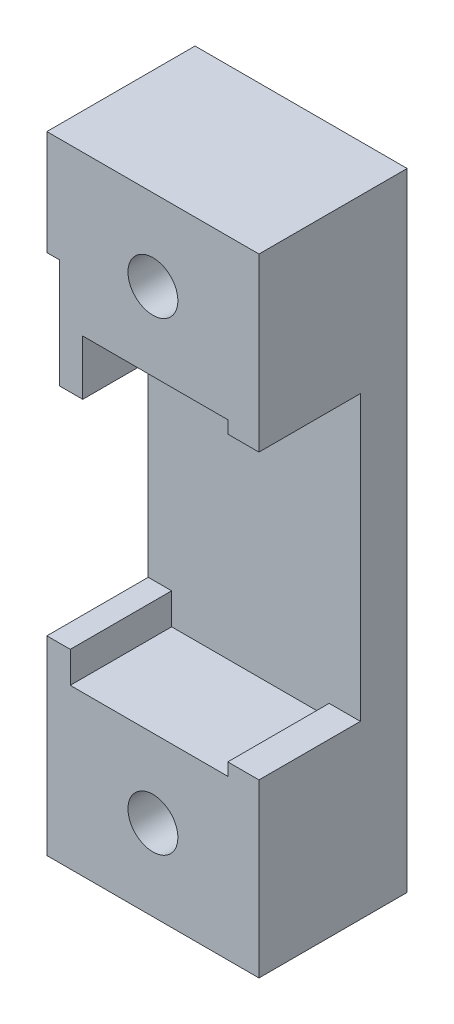
ISO-10303-21;
HEADER;
FILE_DESCRIPTION(('STEP AP214'),'2;1');
FILE_NAME('part.step','',(''),(''),'','','');
FILE_SCHEMA(('AUTOMOTIVE_DESIGN { 1 0 10303 214 1 1 1 1 }'));
ENDSEC;
DATA;
#1=APPLICATION_CONTEXT('core data for automotive mechanical design processes');
#2=APPLICATION_PROTOCOL_DEFINITION('international standard','automotive_design',2000,#1);
#3=PRODUCT_CONTEXT('',#1,'mechanical');
#4=PRODUCT('Part','Part','',(#3));
#5=PRODUCT_RELATED_PRODUCT_CATEGORY('part','',(#4));
#6=PRODUCT_DEFINITION_FORMATION('','',#4);
#7=PRODUCT_DEFINITION_CONTEXT('part definition',#1,'design');
#8=PRODUCT_DEFINITION('design','',#6,#7);
#9=PRODUCT_DEFINITION_SHAPE('','',#8);
#10=(LENGTH_UNIT() NAMED_UNIT(*) SI_UNIT(.MILLI.,.METRE.));
#11=(NAMED_UNIT(*) PLANE_ANGLE_UNIT() SI_UNIT($,.RADIAN.));
#12=(NAMED_UNIT(*) SI_UNIT($,.STERADIAN.) SOLID_ANGLE_UNIT());
#13=UNCERTAINTY_MEASURE_WITH_UNIT(LENGTH_MEASURE(1.E-05),#10,'distance_accuracy_value','');
#14=(GEOMETRIC_REPRESENTATION_CONTEXT(3) GLOBAL_UNCERTAINTY_ASSIGNED_CONTEXT((#13)) GLOBAL_UNIT_ASSIGNED_CONTEXT((#10,
#11,#12)) REPRESENTATION_CONTEXT('',''));
#15=CARTESIAN_POINT('',(0.,0.,0.));
#16=DIRECTION('',(0.,0.,1.));
#17=DIRECTION('',(1.,0.,0.));
#18=AXIS2_PLACEMENT_3D('',#15,#16,#17);
#19=CARTESIAN_POINT('',(-10.1,0.,6.5));
#20=DIRECTION('',(1.,0.,0.));
#21=DIRECTION('',(0.,0.,-1.));
#22=AXIS2_PLACEMENT_3D('',#19,#20,#21);
#23=PLANE('',#22);
#24=DIRECTION('',(0.,-1.,0.));
#25=VECTOR('',#24,1.);
#26=CARTESIAN_POINT('',(-10.1,0.,0.));
#27=LINE('',#26,#25);
#28=CARTESIAN_POINT('',(-10.1,-7.9,0.));
#29=VERTEX_POINT('',#28);
#30=CARTESIAN_POINT('',(-10.1,-9.9,0.));
#31=VERTEX_POINT('',#30);
#32=EDGE_CURVE('E305',#29,#31,#27,.T.);
#33=ORIENTED_EDGE('',*,*,#32,.F.);
#34=DIRECTION('',(0.,0.,-1.));
#35=VECTOR('',#34,1.);
#36=CARTESIAN_POINT('',(-10.1,-7.9,6.5));
#37=LINE('',#36,#35);
#38=CARTESIAN_POINT('',(-10.1,-7.9,6.5));
#39=VERTEX_POINT('',#38);
#40=EDGE_CURVE('E11',#39,#29,#37,.T.);
#41=ORIENTED_EDGE('',*,*,#40,.F.);
#42=DIRECTION('',(0.,-1.,0.));
#43=VECTOR('',#42,1.);
#44=CARTESIAN_POINT('',(-10.1,0.,6.5));
#45=LINE('',#44,#43);
#46=CARTESIAN_POINT('',(-10.1,-9.9,6.5));
#47=VERTEX_POINT('',#46);
#48=EDGE_CURVE('E308',#39,#47,#45,.T.);
#49=ORIENTED_EDGE('',*,*,#48,.T.);
#50=DIRECTION('',(0.,0.,-1.));
#51=VECTOR('',#50,1.);
#52=CARTESIAN_POINT('',(-10.1,-9.9,6.5));
#53=LINE('',#52,#51);
#54=EDGE_CURVE('E344',#47,#31,#53,.T.);
#55=ORIENTED_EDGE('',*,*,#54,.T.);
#56=EDGE_LOOP('',(#33,#41,#49,#55));
#57=FACE_BOUND('',#56,.T.);
#58=ADVANCED_FACE('F47',(#57),#23,.T.);
#59=CARTESIAN_POINT('',(0.,-7.9,6.5));
#60=DIRECTION('',(0.,1.,0.));
#61=DIRECTION('',(0.,0.,1.));
#62=AXIS2_PLACEMENT_3D('',#59,#60,#61);
#63=PLANE('',#62);
#64=DIRECTION('',(1.,0.,0.));
#65=VECTOR('',#64,1.);
#66=CARTESIAN_POINT('',(0.,-7.9,0.));
#67=LINE('',#66,#65);
#68=CARTESIAN_POINT('',(-11.6,-7.9,0.));
#69=VERTEX_POINT('',#68);
#70=EDGE_CURVE('E348',#69,#29,#67,.T.);
#71=ORIENTED_EDGE('',*,*,#70,.F.);
#72=DIRECTION('',(0.,0.,-1.));
#73=VECTOR('',#72,1.);
#74=CARTESIAN_POINT('',(-11.6,-7.9,6.5));
#75=LINE('',#74,#73);
#76=CARTESIAN_POINT('',(-11.6,-7.9,6.5));
#77=VERTEX_POINT('',#76);
#78=EDGE_CURVE('E56',#77,#69,#75,.T.);
#79=ORIENTED_EDGE('',*,*,#78,.F.);
#80=DIRECTION('',(1.,0.,0.));
#81=VECTOR('',#80,1.);
#82=CARTESIAN_POINT('',(0.,-7.9,6.5));
#83=LINE('',#82,#81);
#84=EDGE_CURVE('E312',#77,#39,#83,.T.);
#85=ORIENTED_EDGE('',*,*,#84,.T.);
#86=ORIENTED_EDGE('',*,*,#40,.T.);
#87=EDGE_LOOP('',(#71,#79,#85,#86));
#88=FACE_BOUND('',#87,.T.);
#89=ADVANCED_FACE('F420',(#88),#63,.T.);
#90=CARTESIAN_POINT('',(-11.6,0.,6.5));
#91=DIRECTION('',(-1.,0.,0.));
#92=DIRECTION('',(0.,0.,1.));
#93=AXIS2_PLACEMENT_3D('',#90,#91,#92);
#94=PLANE('',#93);
#95=ORIENTED_EDGE('',*,*,#78,.T.);
#96=DIRECTION('',(0.,1.,0.));
#97=VECTOR('',#96,1.);
#98=CARTESIAN_POINT('',(-11.6,0.,0.));
#99=LINE('',#98,#97);
#100=CARTESIAN_POINT('',(-11.6,13.3788987470405,0.));
#101=VERTEX_POINT('',#100);
#102=EDGE_CURVE('E180',#69,#101,#99,.T.);
#103=ORIENTED_EDGE('',*,*,#102,.T.);
#104=DIRECTION('',(0.,0.,-1.));
#105=VECTOR('',#104,1.);
#106=CARTESIAN_POINT('',(-11.6,13.3788987470405,6.5));
#107=LINE('',#106,#105);
#108=CARTESIAN_POINT('',(-11.6,13.3788987470405,6.5));
#109=VERTEX_POINT('',#108);
#110=EDGE_CURVE('E174',#109,#101,#107,.T.);
#111=ORIENTED_EDGE('',*,*,#110,.F.);
#112=DIRECTION('',(0.,1.,0.));
#113=VECTOR('',#112,1.);
#114=CARTESIAN_POINT('',(-11.6,0.,6.5));
#115=LINE('',#114,#113);
#116=CARTESIAN_POINT('',(-11.6,20.1,6.5));
#117=VERTEX_POINT('',#116);
#118=EDGE_CURVE('E178',#109,#117,#115,.T.);
#119=ORIENTED_EDGE('',*,*,#118,.T.);
#120=DIRECTION('',(0.,0.,1.));
#121=VECTOR('',#120,1.);
#122=CARTESIAN_POINT('',(-11.6,20.1,-3.));
#123=LINE('',#122,#121);
#124=CARTESIAN_POINT('',(-11.6,20.1,-3.));
#125=VERTEX_POINT('',#124);
#126=EDGE_CURVE('E302',#125,#117,#123,.T.);
#127=ORIENTED_EDGE('',*,*,#126,.F.);
#128=DIRECTION('',(0.,1.,0.));
#129=VECTOR('',#128,1.);
#130=CARTESIAN_POINT('',(-11.6,0.,-3.));
#131=LINE('',#130,#129);
#132=CARTESIAN_POINT('',(-11.6,-20.1,-3.));
#133=VERTEX_POINT('',#132);
#134=EDGE_CURVE('E281',#133,#125,#131,.T.);
#135=ORIENTED_EDGE('',*,*,#134,.F.);
#136=DIRECTION('',(0.,0.,-1.));
#137=VECTOR('',#136,1.);
#138=CARTESIAN_POINT('',(-11.6,-20.1,6.5));
#139=LINE('',#138,#137);
#140=CARTESIAN_POINT('',(-11.6,-20.1,6.5));
#141=VERTEX_POINT('',#140);
#142=EDGE_CURVE('E377',#141,#133,#139,.T.);
#143=ORIENTED_EDGE('',*,*,#142,.F.);
#144=DIRECTION('',(0.,1.,0.));
#145=VECTOR('',#144,1.);
#146=CARTESIAN_POINT('',(-11.6,0.,6.5));
#147=LINE('',#146,#145);
#148=EDGE_CURVE('E317',#141,#77,#147,.T.);
#149=ORIENTED_EDGE('',*,*,#148,.T.);
#150=EDGE_LOOP('',(#95,#103,#111,#119,#127,#135,#143,#149));
#151=FACE_BOUND('',#150,.T.);
#152=ADVANCED_FACE('F176',(#151),#94,.T.);
#153=CARTESIAN_POINT('',(0.,-20.1,6.5));
#154=DIRECTION('',(0.,-1.,0.));
#155=DIRECTION('',(1.,0.,0.));
#156=AXIS2_PLACEMENT_3D('',#153,#154,#155);
#157=PLANE('',#156);
#158=ORIENTED_EDGE('',*,*,#142,.T.);
#159=DIRECTION('',(-1.,0.,0.));
#160=VECTOR('',#159,1.);
#161=CARTESIAN_POINT('',(0.,-20.1,-3.));
#162=LINE('',#161,#160);
#163=CARTESIAN_POINT('',(2.,-20.1,-3.));
#164=VERTEX_POINT('',#163);
#165=EDGE_CURVE('E284',#164,#133,#162,.T.);
#166=ORIENTED_EDGE('',*,*,#165,.F.);
#167=DIRECTION('',(0.,0.,-1.));
#168=VECTOR('',#167,1.);
#169=CARTESIAN_POINT('',(2.,-20.1,6.5));
#170=LINE('',#169,#168);
#171=CARTESIAN_POINT('',(2.,-20.1,6.5));
#172=VERTEX_POINT('',#171);
#173=EDGE_CURVE('E374',#172,#164,#170,.T.);
#174=ORIENTED_EDGE('',*,*,#173,.F.);
#175=DIRECTION('',(-1.,0.,0.));
#176=VECTOR('',#175,1.);
#177=CARTESIAN_POINT('',(0.,-20.1,6.5));
#178=LINE('',#177,#176);
#179=EDGE_CURVE('E321',#172,#141,#178,.T.);
#180=ORIENTED_EDGE('',*,*,#179,.T.);
#181=EDGE_LOOP('',(#158,#166,#174,#180));
#182=FACE_BOUND('',#181,.T.);
#183=ADVANCED_FACE('F498',(#182),#157,.T.);
#184=CARTESIAN_POINT('',(2.,0.,6.5));
#185=DIRECTION('',(1.,0.,0.));
#186=DIRECTION('',(0.,1.,0.));
#187=AXIS2_PLACEMENT_3D('',#184,#185,#186);
#188=PLANE('',#187);
#189=ORIENTED_EDGE('',*,*,#173,.T.);
#190=DIRECTION('',(0.,1.,0.));
#191=VECTOR('',#190,1.);
#192=CARTESIAN_POINT('',(2.,0.,-3.));
#193=LINE('',#192,#191);
#194=CARTESIAN_POINT('',(2.,20.1,-3.));
#195=VERTEX_POINT('',#194);
#196=EDGE_CURVE('E289',#164,#195,#193,.T.);
#197=ORIENTED_EDGE('',*,*,#196,.T.);
#198=DIRECTION('',(0.,0.,1.));
#199=VECTOR('',#198,1.);
#200=CARTESIAN_POINT('',(2.,20.1,-3.));
#201=LINE('',#200,#199);
#202=CARTESIAN_POINT('',(2.,20.1,6.5));
#203=VERTEX_POINT('',#202);
#204=EDGE_CURVE('E297',#195,#203,#201,.T.);
#205=ORIENTED_EDGE('',*,*,#204,.T.);
#206=DIRECTION('',(0.,1.,0.));
#207=VECTOR('',#206,1.);
#208=CARTESIAN_POINT('',(2.,0.,6.5));
#209=LINE('',#208,#207);
#210=CARTESIAN_POINT('',(2.,9.1,6.5));
#211=VERTEX_POINT('',#210);
#212=EDGE_CURVE('E226',#211,#203,#209,.T.);
#213=ORIENTED_EDGE('',*,*,#212,.F.);
#214=DIRECTION('',(0.,0.,-1.));
#215=VECTOR('',#214,1.);
#216=CARTESIAN_POINT('',(2.,9.1,6.5));
#217=LINE('',#216,#215);
#218=CARTESIAN_POINT('',(2.,9.1,0.));
#219=VERTEX_POINT('',#218);
#220=EDGE_CURVE('E235',#211,#219,#217,.T.);
#221=ORIENTED_EDGE('',*,*,#220,.T.);
#222=DIRECTION('',(0.,1.,0.));
#223=VECTOR('',#222,1.);
#224=CARTESIAN_POINT('',(2.,0.,0.));
#225=LINE('',#224,#223);
#226=CARTESIAN_POINT('',(2.,-9.1,0.));
#227=VERTEX_POINT('',#226);
#228=EDGE_CURVE('E285',#227,#219,#225,.T.);
#229=ORIENTED_EDGE('',*,*,#228,.F.);
#230=DIRECTION('',(0.,0.,-1.));
#231=VECTOR('',#230,1.);
#232=CARTESIAN_POINT('',(2.,-9.1,6.5));
#233=LINE('',#232,#231);
#234=CARTESIAN_POINT('',(2.,-9.1,6.5));
#235=VERTEX_POINT('',#234);
#236=EDGE_CURVE('E371',#235,#227,#233,.T.);
#237=ORIENTED_EDGE('',*,*,#236,.F.);
#238=DIRECTION('',(0.,-1.,0.));
#239=VECTOR('',#238,1.);
#240=CARTESIAN_POINT('',(2.,0.,6.5));
#241=LINE('',#240,#239);
#242=EDGE_CURVE('E325',#235,#172,#241,.T.);
#243=ORIENTED_EDGE('',*,*,#242,.T.);
#244=EDGE_LOOP('',(#189,#197,#205,#213,#221,#229,#237,#243));
#245=FACE_BOUND('',#244,.T.);
#246=ADVANCED_FACE('F490',(#245),#188,.T.);
#247=CARTESIAN_POINT('',(0.,-9.1,6.5));
#248=DIRECTION('',(0.,1.,0.));
#249=DIRECTION('',(0.,0.,1.));
#250=AXIS2_PLACEMENT_3D('',#247,#248,#249);
#251=PLANE('',#250);
#252=DIRECTION('',(1.,0.,0.));
#253=VECTOR('',#252,1.);
#254=CARTESIAN_POINT('',(0.,-9.1,0.));
#255=LINE('',#254,#253);
#256=CARTESIAN_POINT('',(0.,-9.1,0.));
#257=VERTEX_POINT('',#256);
#258=EDGE_CURVE('E352',#257,#227,#255,.T.);
#259=ORIENTED_EDGE('',*,*,#258,.F.);
#260=DIRECTION('',(0.,0.,-1.));
#261=VECTOR('',#260,1.);
#262=CARTESIAN_POINT('',(0.,-9.1,6.5));
#263=LINE('',#262,#261);
#264=CARTESIAN_POINT('',(0.,-9.1,6.5));
#265=VERTEX_POINT('',#264);
#266=EDGE_CURVE('E368',#265,#257,#263,.T.);
#267=ORIENTED_EDGE('',*,*,#266,.F.);
#268=DIRECTION('',(1.,0.,0.));
#269=VECTOR('',#268,1.);
#270=CARTESIAN_POINT('',(0.,-9.1,6.5));
#271=LINE('',#270,#269);
#272=EDGE_CURVE('E329',#265,#235,#271,.T.);
#273=ORIENTED_EDGE('',*,*,#272,.T.);
#274=ORIENTED_EDGE('',*,*,#236,.T.);
#275=EDGE_LOOP('',(#259,#267,#273,#274));
#276=FACE_BOUND('',#275,.T.);
#277=ADVANCED_FACE('F504',(#276),#251,.T.);
#278=CARTESIAN_POINT('',(0.,0.,6.5));
#279=DIRECTION('',(-1.,0.,0.));
#280=DIRECTION('',(0.,0.,1.));
#281=AXIS2_PLACEMENT_3D('',#278,#279,#280);
#282=PLANE('',#281);
#283=DIRECTION('',(0.,1.,0.));
#284=VECTOR('',#283,1.);
#285=CARTESIAN_POINT('',(0.,0.,0.));
#286=LINE('',#285,#284);
#287=CARTESIAN_POINT('',(0.,-9.9,0.));
#288=VERTEX_POINT('',#287);
#289=EDGE_CURVE('E356',#288,#257,#286,.T.);
#290=ORIENTED_EDGE('',*,*,#289,.F.);
#291=DIRECTION('',(0.,0.,-1.));
#292=VECTOR('',#291,1.);
#293=CARTESIAN_POINT('',(0.,-9.9,6.5));
#294=LINE('',#293,#292);
#295=CARTESIAN_POINT('',(0.,-9.9,6.5));
#296=VERTEX_POINT('',#295);
#297=EDGE_CURVE('E365',#296,#288,#294,.T.);
#298=ORIENTED_EDGE('',*,*,#297,.F.);
#299=DIRECTION('',(0.,1.,0.));
#300=VECTOR('',#299,1.);
#301=CARTESIAN_POINT('',(0.,0.,6.5));
#302=LINE('',#301,#300);
#303=EDGE_CURVE('E333',#296,#265,#302,.T.);
#304=ORIENTED_EDGE('',*,*,#303,.T.);
#305=ORIENTED_EDGE('',*,*,#266,.T.);
#306=EDGE_LOOP('',(#290,#298,#304,#305));
#307=FACE_BOUND('',#306,.T.);
#308=ADVANCED_FACE('F507',(#307),#282,.T.);
#309=CARTESIAN_POINT('',(0.,-9.9,6.5));
#310=DIRECTION('',(0.,-1.,0.));
#311=DIRECTION('',(0.,0.,-1.));
#312=AXIS2_PLACEMENT_3D('',#309,#310,#311);
#313=PLANE('',#312);
#314=DIRECTION('',(-1.,0.,0.));
#315=VECTOR('',#314,1.);
#316=CARTESIAN_POINT('',(0.,-9.9,0.));
#317=LINE('',#316,#315);
#318=EDGE_CURVE('E313',#288,#31,#317,.T.);
#319=ORIENTED_EDGE('',*,*,#318,.T.);
#320=ORIENTED_EDGE('',*,*,#54,.F.);
#321=DIRECTION('',(-1.,0.,0.));
#322=VECTOR('',#321,1.);
#323=CARTESIAN_POINT('',(0.,-9.9,6.5));
#324=LINE('',#323,#322);
#325=EDGE_CURVE('E337',#296,#47,#324,.T.);
#326=ORIENTED_EDGE('',*,*,#325,.F.);
#327=ORIENTED_EDGE('',*,*,#297,.T.);
#328=EDGE_LOOP('',(#319,#320,#326,#327));
#329=FACE_BOUND('',#328,.T.);
#330=ADVANCED_FACE('F405',(#329),#313,.F.);
#331=CARTESIAN_POINT('',(-4.8,-14.9,6.5));
#332=DIRECTION('',(0.,0.,-1.));
#333=DIRECTION('',(-1.,0.,0.));
#334=AXIS2_PLACEMENT_3D('',#331,#332,#333);
#335=CYLINDRICAL_SURFACE('',#334,1.6);
#336=CARTESIAN_POINT('',(-4.8,-14.9,0.5));
#337=DIRECTION('',(0.,0.,1.));
#338=DIRECTION('',(1.,0.,0.));
#339=AXIS2_PLACEMENT_3D('',#336,#337,#338);
#340=CIRCLE('',#339,1.6);
#341=CARTESIAN_POINT('',(-3.2,-14.9,0.5));
#342=VERTEX_POINT('',#341);
#343=EDGE_CURVE('E50',#342,#342,#340,.T.);
#344=ORIENTED_EDGE('',*,*,#343,.F.);
#345=EDGE_LOOP('',(#344));
#346=FACE_BOUND('',#345,.T.);
#347=CARTESIAN_POINT('',(-4.8,-14.9,6.5));
#348=DIRECTION('',(0.,0.,1.));
#349=DIRECTION('',(1.,0.,0.));
#350=AXIS2_PLACEMENT_3D('',#347,#348,#349);
#351=CIRCLE('',#350,1.6);
#352=CARTESIAN_POINT('',(-3.2,-14.9,6.5));
#353=VERTEX_POINT('',#352);
#354=EDGE_CURVE('E340',#353,#353,#351,.T.);
#355=ORIENTED_EDGE('',*,*,#354,.T.);
#356=EDGE_LOOP('',(#355));
#357=FACE_BOUND('',#356,.T.);
#358=ADVANCED_FACE('F401',(#346,#357),#335,.F.);
#359=CARTESIAN_POINT('',(0.,0.,6.5));
#360=DIRECTION('',(0.,0.,1.));
#361=DIRECTION('',(1.,0.,0.));
#362=AXIS2_PLACEMENT_3D('',#359,#360,#361);
#363=PLANE('',#362);
#364=ORIENTED_EDGE('',*,*,#48,.F.);
#365=ORIENTED_EDGE('',*,*,#84,.F.);
#366=ORIENTED_EDGE('',*,*,#148,.F.);
#367=ORIENTED_EDGE('',*,*,#179,.F.);
#368=ORIENTED_EDGE('',*,*,#242,.F.);
#369=ORIENTED_EDGE('',*,*,#272,.F.);
#370=ORIENTED_EDGE('',*,*,#303,.F.);
#371=ORIENTED_EDGE('',*,*,#325,.T.);
#372=EDGE_LOOP('',(#364,#365,#366,#367,#368,#369,#370,#371));
#373=FACE_BOUND('',#372,.T.);
#374=ORIENTED_EDGE('',*,*,#354,.F.);
#375=EDGE_LOOP('',(#374));
#376=FACE_BOUND('',#375,.T.);
#377=ADVANCED_FACE('F404',(#373,#376),#363,.T.);
#378=CARTESIAN_POINT('',(0.,20.1,-3.));
#379=DIRECTION('',(0.,1.,0.));
#380=DIRECTION('',(0.,0.,1.));
#381=AXIS2_PLACEMENT_3D('',#378,#379,#380);
#382=PLANE('',#381);
#383=ORIENTED_EDGE('',*,*,#126,.T.);
#384=DIRECTION('',(-1.,0.,0.));
#385=VECTOR('',#384,1.);
#386=CARTESIAN_POINT('',(0.,20.1,6.5));
#387=LINE('',#386,#385);
#388=EDGE_CURVE('E197',#203,#117,#387,.T.);
#389=ORIENTED_EDGE('',*,*,#388,.F.);
#390=ORIENTED_EDGE('',*,*,#204,.F.);
#391=DIRECTION('',(-1.,0.,0.));
#392=VECTOR('',#391,1.);
#393=CARTESIAN_POINT('',(0.,20.1,-3.));
#394=LINE('',#393,#392);
#395=EDGE_CURVE('E293',#195,#125,#394,.T.);
#396=ORIENTED_EDGE('',*,*,#395,.T.);
#397=EDGE_LOOP('',(#383,#389,#390,#396));
#398=FACE_BOUND('',#397,.T.);
#399=ADVANCED_FACE('F410',(#398),#382,.T.);
#400=CARTESIAN_POINT('',(-4.8,14.9,-3.));
#401=DIRECTION('',(0.,0.,1.));
#402=DIRECTION('',(1.,0.,0.));
#403=AXIS2_PLACEMENT_3D('',#400,#401,#402);
#404=CYLINDRICAL_SURFACE('',#403,1.6);
#405=CARTESIAN_POINT('',(-4.8,14.9,0.5));
#406=DIRECTION('',(0.,0.,1.));
#407=DIRECTION('',(1.,0.,0.));
#408=AXIS2_PLACEMENT_3D('',#405,#406,#407);
#409=CIRCLE('',#408,1.6);
#410=CARTESIAN_POINT('',(-3.2,14.9,0.5));
#411=VERTEX_POINT('',#410);
#412=EDGE_CURVE('E390',#411,#411,#409,.F.);
#413=ORIENTED_EDGE('',*,*,#412,.T.);
#414=EDGE_LOOP('',(#413));
#415=FACE_BOUND('',#414,.T.);
#416=CARTESIAN_POINT('',(-4.8,14.9,6.5));
#417=DIRECTION('',(0.,0.,1.));
#418=DIRECTION('',(1.,0.,0.));
#419=AXIS2_PLACEMENT_3D('',#416,#417,#418);
#420=CIRCLE('',#419,1.6);
#421=CARTESIAN_POINT('',(-3.2,14.9,6.5));
#422=VERTEX_POINT('',#421);
#423=EDGE_CURVE('E231',#422,#422,#420,.T.);
#424=ORIENTED_EDGE('',*,*,#423,.T.);
#425=EDGE_LOOP('',(#424));
#426=FACE_BOUND('',#425,.T.);
#427=ADVANCED_FACE('F415',(#415,#426),#404,.F.);
#428=CARTESIAN_POINT('',(0.,0.,-3.));
#429=DIRECTION('',(0.,0.,1.));
#430=DIRECTION('',(1.,0.,0.));
#431=AXIS2_PLACEMENT_3D('',#428,#429,#430);
#432=PLANE('',#431);
#433=CARTESIAN_POINT('',(-4.8,14.9,-3.));
#434=DIRECTION('',(0.,0.,1.));
#435=DIRECTION('',(1.,0.,0.));
#436=AXIS2_PLACEMENT_3D('',#433,#434,#435);
#437=CIRCLE('',#436,2.85);
#438=CARTESIAN_POINT('',(-1.95,14.9,-3.));
#439=VERTEX_POINT('',#438);
#440=EDGE_CURVE('E386',#439,#439,#437,.T.);
#441=ORIENTED_EDGE('',*,*,#440,.T.);
#442=EDGE_LOOP('',(#441));
#443=FACE_BOUND('',#442,.T.);
#444=CARTESIAN_POINT('',(-4.8,-14.9,-3.));
#445=DIRECTION('',(0.,0.,1.));
#446=DIRECTION('',(1.,0.,0.));
#447=AXIS2_PLACEMENT_3D('',#444,#445,#446);
#448=CIRCLE('',#447,2.85);
#449=CARTESIAN_POINT('',(-1.95,-14.9,-3.));
#450=VERTEX_POINT('',#449);
#451=EDGE_CURVE('E382',#450,#450,#448,.T.);
#452=ORIENTED_EDGE('',*,*,#451,.T.);
#453=EDGE_LOOP('',(#452));
#454=FACE_BOUND('',#453,.T.);
#455=ORIENTED_EDGE('',*,*,#134,.T.);
#456=ORIENTED_EDGE('',*,*,#395,.F.);
#457=ORIENTED_EDGE('',*,*,#196,.F.);
#458=ORIENTED_EDGE('',*,*,#165,.T.);
#459=EDGE_LOOP('',(#455,#456,#457,#458));
#460=FACE_BOUND('',#459,.T.);
#461=ADVANCED_FACE('F431',(#443,#454,#460),#432,.F.);
#462=CARTESIAN_POINT('',(0.,0.,0.));
#463=DIRECTION('',(0.,0.,1.));
#464=DIRECTION('',(1.,0.,0.));
#465=AXIS2_PLACEMENT_3D('',#462,#463,#464);
#466=PLANE('',#465);
#467=DIRECTION('',(-1.,0.,0.));
#468=VECTOR('',#467,1.);
#469=CARTESIAN_POINT('',(0.,13.3788987470405,0.));
#470=LINE('',#469,#468);
#471=CARTESIAN_POINT('',(-10.8,13.3788987470405,0.));
#472=VERTEX_POINT('',#471);
#473=EDGE_CURVE('E236',#472,#101,#470,.T.);
#474=ORIENTED_EDGE('',*,*,#473,.T.);
#475=ORIENTED_EDGE('',*,*,#102,.F.);
#476=ORIENTED_EDGE('',*,*,#70,.T.);
#477=ORIENTED_EDGE('',*,*,#32,.T.);
#478=ORIENTED_EDGE('',*,*,#318,.F.);
#479=ORIENTED_EDGE('',*,*,#289,.T.);
#480=ORIENTED_EDGE('',*,*,#258,.T.);
#481=ORIENTED_EDGE('',*,*,#228,.T.);
#482=DIRECTION('',(1.,0.,0.));
#483=VECTOR('',#482,1.);
#484=CARTESIAN_POINT('',(0.,9.1,0.));
#485=LINE('',#484,#483);
#486=CARTESIAN_POINT('',(0.,9.1,0.));
#487=VERTEX_POINT('',#486);
#488=EDGE_CURVE('E199',#487,#219,#485,.T.);
#489=ORIENTED_EDGE('',*,*,#488,.F.);
#490=DIRECTION('',(0.,-1.,0.));
#491=VECTOR('',#490,1.);
#492=CARTESIAN_POINT('',(0.,0.,0.));
#493=LINE('',#492,#491);
#494=CARTESIAN_POINT('',(0.,9.9,0.));
#495=VERTEX_POINT('',#494);
#496=EDGE_CURVE('E250',#495,#487,#493,.T.);
#497=ORIENTED_EDGE('',*,*,#496,.F.);
#498=DIRECTION('',(-1.,0.,0.));
#499=VECTOR('',#498,1.);
#500=CARTESIAN_POINT('',(0.,9.9,0.));
#501=LINE('',#500,#499);
#502=CARTESIAN_POINT('',(-9.3,9.9,0.));
#503=VERTEX_POINT('',#502);
#504=EDGE_CURVE('E247',#495,#503,#501,.T.);
#505=ORIENTED_EDGE('',*,*,#504,.T.);
#506=DIRECTION('',(0.,1.,0.));
#507=VECTOR('',#506,1.);
#508=CARTESIAN_POINT('',(-9.3,0.,0.));
#509=LINE('',#508,#507);
#510=CARTESIAN_POINT('',(-9.3,6.37889874704045,0.));
#511=VERTEX_POINT('',#510);
#512=EDGE_CURVE('E243',#511,#503,#509,.T.);
#513=ORIENTED_EDGE('',*,*,#512,.F.);
#514=DIRECTION('',(1.,0.,0.));
#515=VECTOR('',#514,1.);
#516=CARTESIAN_POINT('',(0.,6.37889874704045,0.));
#517=LINE('',#516,#515);
#518=CARTESIAN_POINT('',(-10.8,6.37889874704045,0.));
#519=VERTEX_POINT('',#518);
#520=EDGE_CURVE('E69',#519,#511,#517,.T.);
#521=ORIENTED_EDGE('',*,*,#520,.F.);
#522=DIRECTION('',(0.,1.,0.));
#523=VECTOR('',#522,1.);
#524=CARTESIAN_POINT('',(-10.8,0.,0.));
#525=LINE('',#524,#523);
#526=EDGE_CURVE('E64',#519,#472,#525,.T.);
#527=ORIENTED_EDGE('',*,*,#526,.T.);
#528=EDGE_LOOP('',(#474,#475,#476,#477,#478,#479,#480,#481,#489,#497,#505,#513,#521,#527));
#529=FACE_BOUND('',#528,.T.);
#530=ADVANCED_FACE('F429',(#529),#466,.T.);
#531=CARTESIAN_POINT('',(0.,13.3788987470405,6.5));
#532=DIRECTION('',(0.,-1.,0.));
#533=DIRECTION('',(0.,0.,-1.));
#534=AXIS2_PLACEMENT_3D('',#531,#532,#533);
#535=PLANE('',#534);
#536=ORIENTED_EDGE('',*,*,#473,.F.);
#537=DIRECTION('',(0.,0.,-1.));
#538=VECTOR('',#537,1.);
#539=CARTESIAN_POINT('',(-10.8,13.3788987470405,6.5));
#540=LINE('',#539,#538);
#541=CARTESIAN_POINT('',(-10.8,13.3788987470405,6.5));
#542=VERTEX_POINT('',#541);
#543=EDGE_CURVE('E185',#542,#472,#540,.T.);
#544=ORIENTED_EDGE('',*,*,#543,.F.);
#545=DIRECTION('',(-1.,0.,0.));
#546=VECTOR('',#545,1.);
#547=CARTESIAN_POINT('',(0.,13.3788987470405,6.5));
#548=LINE('',#547,#546);
#549=EDGE_CURVE('E193',#542,#109,#548,.T.);
#550=ORIENTED_EDGE('',*,*,#549,.T.);
#551=ORIENTED_EDGE('',*,*,#110,.T.);
#552=EDGE_LOOP('',(#536,#544,#550,#551));
#553=FACE_BOUND('',#552,.T.);
#554=ADVANCED_FACE('F201',(#553),#535,.T.);
#555=CARTESIAN_POINT('',(-10.8,0.,6.5));
#556=DIRECTION('',(-1.,0.,0.));
#557=DIRECTION('',(0.,0.,1.));
#558=AXIS2_PLACEMENT_3D('',#555,#556,#557);
#559=PLANE('',#558);
#560=ORIENTED_EDGE('',*,*,#526,.F.);
#561=DIRECTION('',(0.,0.,-1.));
#562=VECTOR('',#561,1.);
#563=CARTESIAN_POINT('',(-10.8,6.37889874704045,6.5));
#564=LINE('',#563,#562);
#565=CARTESIAN_POINT('',(-10.8,6.37889874704045,6.5));
#566=VERTEX_POINT('',#565);
#567=EDGE_CURVE('E276',#566,#519,#564,.T.);
#568=ORIENTED_EDGE('',*,*,#567,.F.);
#569=DIRECTION('',(0.,1.,0.));
#570=VECTOR('',#569,1.);
#571=CARTESIAN_POINT('',(-10.8,0.,6.5));
#572=LINE('',#571,#570);
#573=EDGE_CURVE('E203',#566,#542,#572,.T.);
#574=ORIENTED_EDGE('',*,*,#573,.T.);
#575=ORIENTED_EDGE('',*,*,#543,.T.);
#576=EDGE_LOOP('',(#560,#568,#574,#575));
#577=FACE_BOUND('',#576,.T.);
#578=ADVANCED_FACE('F436',(#577),#559,.T.);
#579=CARTESIAN_POINT('',(0.,6.37889874704045,6.5));
#580=DIRECTION('',(0.,1.,0.));
#581=DIRECTION('',(0.,0.,1.));
#582=AXIS2_PLACEMENT_3D('',#579,#580,#581);
#583=PLANE('',#582);
#584=ORIENTED_EDGE('',*,*,#520,.T.);
#585=DIRECTION('',(0.,0.,-1.));
#586=VECTOR('',#585,1.);
#587=CARTESIAN_POINT('',(-9.3,6.37889874704045,6.5));
#588=LINE('',#587,#586);
#589=CARTESIAN_POINT('',(-9.3,6.37889874704045,6.5));
#590=VERTEX_POINT('',#589);
#591=EDGE_CURVE('E272',#590,#511,#588,.T.);
#592=ORIENTED_EDGE('',*,*,#591,.F.);
#593=DIRECTION('',(1.,0.,0.));
#594=VECTOR('',#593,1.);
#595=CARTESIAN_POINT('',(0.,6.37889874704045,6.5));
#596=LINE('',#595,#594);
#597=EDGE_CURVE('E207',#566,#590,#596,.T.);
#598=ORIENTED_EDGE('',*,*,#597,.F.);
#599=ORIENTED_EDGE('',*,*,#567,.T.);
#600=EDGE_LOOP('',(#584,#592,#598,#599));
#601=FACE_BOUND('',#600,.T.);
#602=ADVANCED_FACE('F469',(#601),#583,.F.);
#603=CARTESIAN_POINT('',(-9.3,0.,6.5));
#604=DIRECTION('',(-1.,0.,0.));
#605=DIRECTION('',(0.,0.,1.));
#606=AXIS2_PLACEMENT_3D('',#603,#604,#605);
#607=PLANE('',#606);
#608=ORIENTED_EDGE('',*,*,#512,.T.);
#609=DIRECTION('',(0.,0.,-1.));
#610=VECTOR('',#609,1.);
#611=CARTESIAN_POINT('',(-9.3,9.9,6.5));
#612=LINE('',#611,#610);
#613=CARTESIAN_POINT('',(-9.3,9.9,6.5));
#614=VERTEX_POINT('',#613);
#615=EDGE_CURVE('E268',#614,#503,#612,.T.);
#616=ORIENTED_EDGE('',*,*,#615,.F.);
#617=DIRECTION('',(0.,1.,0.));
#618=VECTOR('',#617,1.);
#619=CARTESIAN_POINT('',(-9.3,0.,6.5));
#620=LINE('',#619,#618);
#621=EDGE_CURVE('E213',#590,#614,#620,.T.);
#622=ORIENTED_EDGE('',*,*,#621,.F.);
#623=ORIENTED_EDGE('',*,*,#591,.T.);
#624=EDGE_LOOP('',(#608,#616,#622,#623));
#625=FACE_BOUND('',#624,.T.);
#626=ADVANCED_FACE('F465',(#625),#607,.F.);
#627=CARTESIAN_POINT('',(0.,9.9,6.5));
#628=DIRECTION('',(0.,-1.,0.));
#629=DIRECTION('',(1.,0.,0.));
#630=AXIS2_PLACEMENT_3D('',#627,#628,#629);
#631=PLANE('',#630);
#632=ORIENTED_EDGE('',*,*,#504,.F.);
#633=DIRECTION('',(0.,0.,-1.));
#634=VECTOR('',#633,1.);
#635=CARTESIAN_POINT('',(0.,9.9,6.5));
#636=LINE('',#635,#634);
#637=CARTESIAN_POINT('',(0.,9.9,6.5));
#638=VERTEX_POINT('',#637);
#639=EDGE_CURVE('E264',#638,#495,#636,.T.);
#640=ORIENTED_EDGE('',*,*,#639,.F.);
#641=DIRECTION('',(-1.,0.,0.));
#642=VECTOR('',#641,1.);
#643=CARTESIAN_POINT('',(0.,9.9,6.5));
#644=LINE('',#643,#642);
#645=EDGE_CURVE('E216',#638,#614,#644,.T.);
#646=ORIENTED_EDGE('',*,*,#645,.T.);
#647=ORIENTED_EDGE('',*,*,#615,.T.);
#648=EDGE_LOOP('',(#632,#640,#646,#647));
#649=FACE_BOUND('',#648,.T.);
#650=ADVANCED_FACE('F461',(#649),#631,.T.);
#651=CARTESIAN_POINT('',(0.,0.,6.5));
#652=DIRECTION('',(1.,0.,0.));
#653=DIRECTION('',(0.,1.,0.));
#654=AXIS2_PLACEMENT_3D('',#651,#652,#653);
#655=PLANE('',#654);
#656=ORIENTED_EDGE('',*,*,#496,.T.);
#657=DIRECTION('',(0.,0.,-1.));
#658=VECTOR('',#657,1.);
#659=CARTESIAN_POINT('',(0.,9.1,6.5));
#660=LINE('',#659,#658);
#661=CARTESIAN_POINT('',(0.,9.1,6.5));
#662=VERTEX_POINT('',#661);
#663=EDGE_CURVE('E260',#662,#487,#660,.T.);
#664=ORIENTED_EDGE('',*,*,#663,.F.);
#665=DIRECTION('',(0.,-1.,0.));
#666=VECTOR('',#665,1.);
#667=CARTESIAN_POINT('',(0.,0.,6.5));
#668=LINE('',#667,#666);
#669=EDGE_CURVE('E220',#638,#662,#668,.T.);
#670=ORIENTED_EDGE('',*,*,#669,.F.);
#671=ORIENTED_EDGE('',*,*,#639,.T.);
#672=EDGE_LOOP('',(#656,#664,#670,#671));
#673=FACE_BOUND('',#672,.T.);
#674=ADVANCED_FACE('F454',(#673),#655,.F.);
#675=CARTESIAN_POINT('',(0.,9.1,6.5));
#676=DIRECTION('',(0.,1.,0.));
#677=DIRECTION('',(-1.,0.,0.));
#678=AXIS2_PLACEMENT_3D('',#675,#676,#677);
#679=PLANE('',#678);
#680=ORIENTED_EDGE('',*,*,#488,.T.);
#681=ORIENTED_EDGE('',*,*,#220,.F.);
#682=DIRECTION('',(1.,0.,0.));
#683=VECTOR('',#682,1.);
#684=CARTESIAN_POINT('',(0.,9.1,6.5));
#685=LINE('',#684,#683);
#686=EDGE_CURVE('E223',#662,#211,#685,.T.);
#687=ORIENTED_EDGE('',*,*,#686,.F.);
#688=ORIENTED_EDGE('',*,*,#663,.T.);
#689=EDGE_LOOP('',(#680,#681,#687,#688));
#690=FACE_BOUND('',#689,.T.);
#691=ADVANCED_FACE('F447',(#690),#679,.F.);
#692=CARTESIAN_POINT('',(0.,0.,6.5));
#693=DIRECTION('',(0.,0.,1.));
#694=DIRECTION('',(1.,0.,0.));
#695=AXIS2_PLACEMENT_3D('',#692,#693,#694);
#696=PLANE('',#695);
#697=ORIENTED_EDGE('',*,*,#118,.F.);
#698=ORIENTED_EDGE('',*,*,#549,.F.);
#699=ORIENTED_EDGE('',*,*,#573,.F.);
#700=ORIENTED_EDGE('',*,*,#597,.T.);
#701=ORIENTED_EDGE('',*,*,#621,.T.);
#702=ORIENTED_EDGE('',*,*,#645,.F.);
#703=ORIENTED_EDGE('',*,*,#669,.T.);
#704=ORIENTED_EDGE('',*,*,#686,.T.);
#705=ORIENTED_EDGE('',*,*,#212,.T.);
#706=ORIENTED_EDGE('',*,*,#388,.T.);
#707=EDGE_LOOP('',(#697,#698,#699,#700,#701,#702,#703,#704,#705,#706));
#708=FACE_BOUND('',#707,.T.);
#709=ORIENTED_EDGE('',*,*,#423,.F.);
#710=EDGE_LOOP('',(#709));
#711=FACE_BOUND('',#710,.T.);
#712=ADVANCED_FACE('F190',(#708,#711),#696,.T.);
#713=CARTESIAN_POINT('',(-4.8,-14.9,-3.000012));
#714=DIRECTION('',(0.,0.,1.));
#715=DIRECTION('',(1.,0.,0.));
#716=AXIS2_PLACEMENT_3D('',#713,#714,#715);
#717=CYLINDRICAL_SURFACE('',#716,2.85);
#718=CARTESIAN_POINT('',(-4.8,-14.9,0.5));
#719=DIRECTION('',(0.,0.,1.));
#720=DIRECTION('',(1.,0.,0.));
#721=AXIS2_PLACEMENT_3D('',#718,#719,#720);
#722=CIRCLE('',#721,2.85);
#723=CARTESIAN_POINT('',(-1.95,-14.9,0.5));
#724=VERTEX_POINT('',#723);
#725=EDGE_CURVE('E782',#724,#724,#722,.T.);
#726=ORIENTED_EDGE('',*,*,#725,.T.);
#727=EDGE_LOOP('',(#726));
#728=FACE_BOUND('',#727,.T.);
#729=ORIENTED_EDGE('',*,*,#451,.F.);
#730=EDGE_LOOP('',(#729));
#731=FACE_BOUND('',#730,.T.);
#732=ADVANCED_FACE('F446',(#728,#731),#717,.F.);
#733=CARTESIAN_POINT('',(-4.8,-14.9,0.5));
#734=DIRECTION('',(0.,0.,1.));
#735=DIRECTION('',(1.,0.,0.));
#736=AXIS2_PLACEMENT_3D('',#733,#734,#735);
#737=PLANE('',#736);
#738=ORIENTED_EDGE('',*,*,#343,.T.);
#739=EDGE_LOOP('',(#738));
#740=FACE_BOUND('',#739,.T.);
#741=ORIENTED_EDGE('',*,*,#725,.F.);
#742=EDGE_LOOP('',(#741));
#743=FACE_BOUND('',#742,.T.);
#744=ADVANCED_FACE('F398',(#740,#743),#737,.F.);
#745=CARTESIAN_POINT('',(-4.8,14.9,0.5));
#746=DIRECTION('',(0.,0.,1.));
#747=DIRECTION('',(1.,0.,0.));
#748=AXIS2_PLACEMENT_3D('',#745,#746,#747);
#749=PLANE('',#748);
#750=CARTESIAN_POINT('',(-4.8,14.9,0.5));
#751=DIRECTION('',(0.,0.,1.));
#752=DIRECTION('',(1.,0.,0.));
#753=AXIS2_PLACEMENT_3D('',#750,#751,#752);
#754=CIRCLE('',#753,2.85);
#755=CARTESIAN_POINT('',(-1.95,14.9,0.5));
#756=VERTEX_POINT('',#755);
#757=EDGE_CURVE('E387',#756,#756,#754,.T.);
#758=ORIENTED_EDGE('',*,*,#757,.F.);
#759=EDGE_LOOP('',(#758));
#760=FACE_BOUND('',#759,.T.);
#761=ORIENTED_EDGE('',*,*,#412,.F.);
#762=EDGE_LOOP('',(#761));
#763=FACE_BOUND('',#762,.T.);
#764=ADVANCED_FACE('F629',(#760,#763),#749,.F.);
#765=CARTESIAN_POINT('',(-4.8,14.9,-3.000012));
#766=DIRECTION('',(0.,0.,1.));
#767=DIRECTION('',(1.,0.,0.));
#768=AXIS2_PLACEMENT_3D('',#765,#766,#767);
#769=CYLINDRICAL_SURFACE('',#768,2.85);
#770=ORIENTED_EDGE('',*,*,#757,.T.);
#771=EDGE_LOOP('',(#770));
#772=FACE_BOUND('',#771,.T.);
#773=ORIENTED_EDGE('',*,*,#440,.F.);
#774=EDGE_LOOP('',(#773));
#775=FACE_BOUND('',#774,.T.);
#776=ADVANCED_FACE('F637',(#772,#775),#769,.F.);
#777=CLOSED_SHELL('',(#58,#89,#152,#183,#246,#277,#308,#330,#358,#377,#399,#427,#461,#530,#554,
#578,#602,#626,#650,#674,#691,#712,#732,#744,#764,#776));
#778=MANIFOLD_SOLID_BREP('B2',#777);
#779=ADVANCED_BREP_SHAPE_REPRESENTATION('',(#18,#778),#14);
#780=SHAPE_DEFINITION_REPRESENTATION(#9,#779);
ENDSEC;
END-ISO-10303-21;
